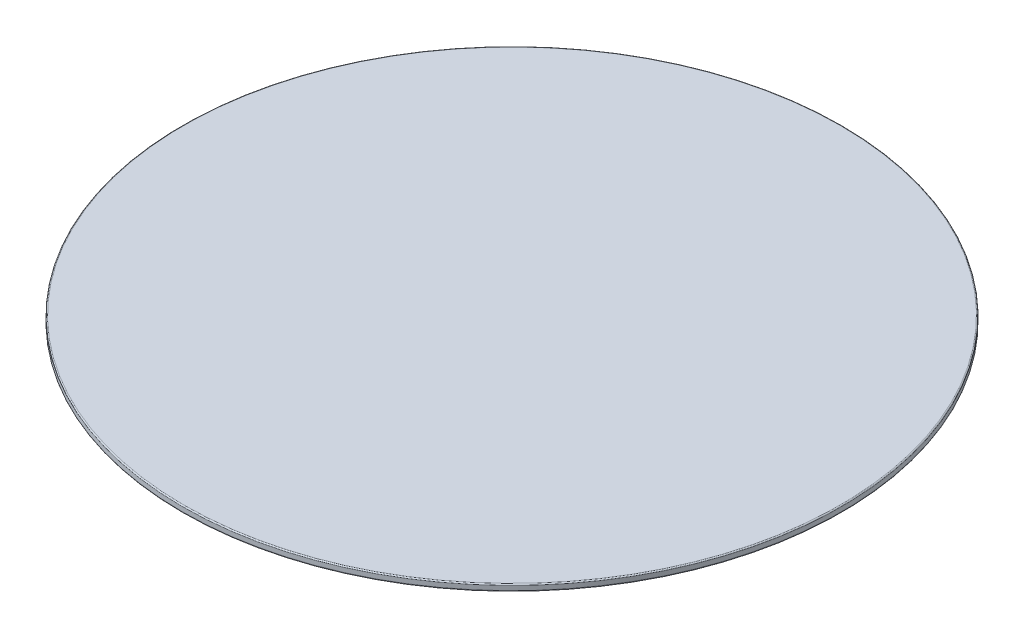
ISO-10303-21;
HEADER;
FILE_DESCRIPTION(('STEP AP214'),'2;1');
FILE_NAME('part.step','',(''),(''),'','','');
FILE_SCHEMA(('AUTOMOTIVE_DESIGN { 1 0 10303 214 1 1 1 1 }'));
ENDSEC;
DATA;
#1=APPLICATION_CONTEXT('core data for automotive mechanical design processes');
#2=APPLICATION_PROTOCOL_DEFINITION('international standard','automotive_design',2000,#1);
#3=PRODUCT_CONTEXT('',#1,'mechanical');
#4=PRODUCT('Part','Part','',(#3));
#5=PRODUCT_RELATED_PRODUCT_CATEGORY('part','',(#4));
#6=PRODUCT_DEFINITION_FORMATION('','',#4);
#7=PRODUCT_DEFINITION_CONTEXT('part definition',#1,'design');
#8=PRODUCT_DEFINITION('design','',#6,#7);
#9=PRODUCT_DEFINITION_SHAPE('','',#8);
#10=(LENGTH_UNIT() NAMED_UNIT(*) SI_UNIT(.MILLI.,.METRE.));
#11=(NAMED_UNIT(*) PLANE_ANGLE_UNIT() SI_UNIT($,.RADIAN.));
#12=(NAMED_UNIT(*) SI_UNIT($,.STERADIAN.) SOLID_ANGLE_UNIT());
#13=UNCERTAINTY_MEASURE_WITH_UNIT(LENGTH_MEASURE(1.E-05),#10,'distance_accuracy_value','');
#14=(GEOMETRIC_REPRESENTATION_CONTEXT(3) GLOBAL_UNCERTAINTY_ASSIGNED_CONTEXT((#13)) GLOBAL_UNIT_ASSIGNED_CONTEXT((#10,
#11,#12)) REPRESENTATION_CONTEXT('',''));
#15=CARTESIAN_POINT('',(0.,0.,0.));
#16=DIRECTION('',(0.,0.,1.));
#17=DIRECTION('',(1.,0.,0.));
#18=AXIS2_PLACEMENT_3D('',#15,#16,#17);
#19=CARTESIAN_POINT('',(0.,3.,0.));
#20=DIRECTION('',(0.,-1.,0.));
#21=DIRECTION('',(0.,0.,-1.));
#22=AXIS2_PLACEMENT_3D('',#19,#20,#21);
#23=CYLINDRICAL_SURFACE('',#22,150.);
#24=CARTESIAN_POINT('',(0.,2.5,0.));
#25=DIRECTION('',(0.,1.,0.));
#26=DIRECTION('',(0.,0.,1.));
#27=AXIS2_PLACEMENT_3D('',#24,#25,#26);
#28=CIRCLE('',#27,150.);
#29=CARTESIAN_POINT('',(0.,2.5,150.));
#30=VERTEX_POINT('',#29);
#31=EDGE_CURVE('E38',#30,#30,#28,.F.);
#32=ORIENTED_EDGE('',*,*,#31,.T.);
#33=EDGE_LOOP('',(#32));
#34=FACE_BOUND('',#33,.T.);
#35=CARTESIAN_POINT('',(0.,0.5,0.));
#36=DIRECTION('',(0.,1.,0.));
#37=DIRECTION('',(0.,0.,1.));
#38=AXIS2_PLACEMENT_3D('',#35,#36,#37);
#39=CIRCLE('',#38,150.);
#40=CARTESIAN_POINT('',(0.,0.5,150.));
#41=VERTEX_POINT('',#40);
#42=EDGE_CURVE('E42',#41,#41,#39,.T.);
#43=ORIENTED_EDGE('',*,*,#42,.T.);
#44=EDGE_LOOP('',(#43));
#45=FACE_BOUND('',#44,.T.);
#46=ADVANCED_FACE('F31',(#34,#45),#23,.T.);
#47=CARTESIAN_POINT('',(0.,3.,0.));
#48=DIRECTION('',(0.,1.,0.));
#49=DIRECTION('',(0.,0.,1.));
#50=AXIS2_PLACEMENT_3D('',#47,#48,#49);
#51=PLANE('',#50);
#52=CARTESIAN_POINT('',(0.,3.,0.));
#53=DIRECTION('',(0.,1.,0.));
#54=DIRECTION('',(0.,0.,1.));
#55=AXIS2_PLACEMENT_3D('',#52,#53,#54);
#56=CIRCLE('',#55,149.5);
#57=CARTESIAN_POINT('',(0.,3.,149.5));
#58=VERTEX_POINT('',#57);
#59=EDGE_CURVE('E46',#58,#58,#56,.T.);
#60=ORIENTED_EDGE('',*,*,#59,.T.);
#61=EDGE_LOOP('',(#60));
#62=FACE_BOUND('',#61,.T.);
#63=ADVANCED_FACE('F52',(#62),#51,.T.);
#64=CARTESIAN_POINT('',(0.,0.,0.));
#65=DIRECTION('',(0.,1.,0.));
#66=DIRECTION('',(0.,0.,1.));
#67=AXIS2_PLACEMENT_3D('',#64,#65,#66);
#68=PLANE('',#67);
#69=CARTESIAN_POINT('',(0.,0.,0.));
#70=DIRECTION('',(0.,1.,0.));
#71=DIRECTION('',(0.,0.,1.));
#72=AXIS2_PLACEMENT_3D('',#69,#70,#71);
#73=CIRCLE('',#72,149.5);
#74=CARTESIAN_POINT('',(0.,0.,149.5));
#75=VERTEX_POINT('',#74);
#76=EDGE_CURVE('E10',#75,#75,#73,.F.);
#77=ORIENTED_EDGE('',*,*,#76,.T.);
#78=EDGE_LOOP('',(#77));
#79=FACE_BOUND('',#78,.T.);
#80=ADVANCED_FACE('F56',(#79),#68,.F.);
#81=CARTESIAN_POINT('',(0.,2.5,0.));
#82=DIRECTION('',(0.,1.,0.));
#83=DIRECTION('',(0.,0.,1.));
#84=AXIS2_PLACEMENT_3D('',#81,#82,#83);
#85=TOROIDAL_SURFACE('',#84,149.5,0.5);
#86=ORIENTED_EDGE('',*,*,#31,.F.);
#87=EDGE_LOOP('',(#86));
#88=FACE_BOUND('',#87,.T.);
#89=ORIENTED_EDGE('',*,*,#59,.F.);
#90=EDGE_LOOP('',(#89));
#91=FACE_BOUND('',#90,.T.);
#92=ADVANCED_FACE('F54',(#88,#91),#85,.T.);
#93=CARTESIAN_POINT('',(0.,0.5,0.));
#94=DIRECTION('',(0.,1.,0.));
#95=DIRECTION('',(0.,0.,1.));
#96=AXIS2_PLACEMENT_3D('',#93,#94,#95);
#97=TOROIDAL_SURFACE('',#96,149.5,0.5);
#98=ORIENTED_EDGE('',*,*,#76,.F.);
#99=EDGE_LOOP('',(#98));
#100=FACE_BOUND('',#99,.T.);
#101=ORIENTED_EDGE('',*,*,#42,.F.);
#102=EDGE_LOOP('',(#101));
#103=FACE_BOUND('',#102,.T.);
#104=ADVANCED_FACE('F33',(#100,#103),#97,.T.);
#105=CLOSED_SHELL('',(#46,#63,#80,#92,#104));
#106=MANIFOLD_SOLID_BREP('B2',#105);
#107=ADVANCED_BREP_SHAPE_REPRESENTATION('',(#18,#106),#14);
#108=SHAPE_DEFINITION_REPRESENTATION(#9,#107);
ENDSEC;
END-ISO-10303-21;
